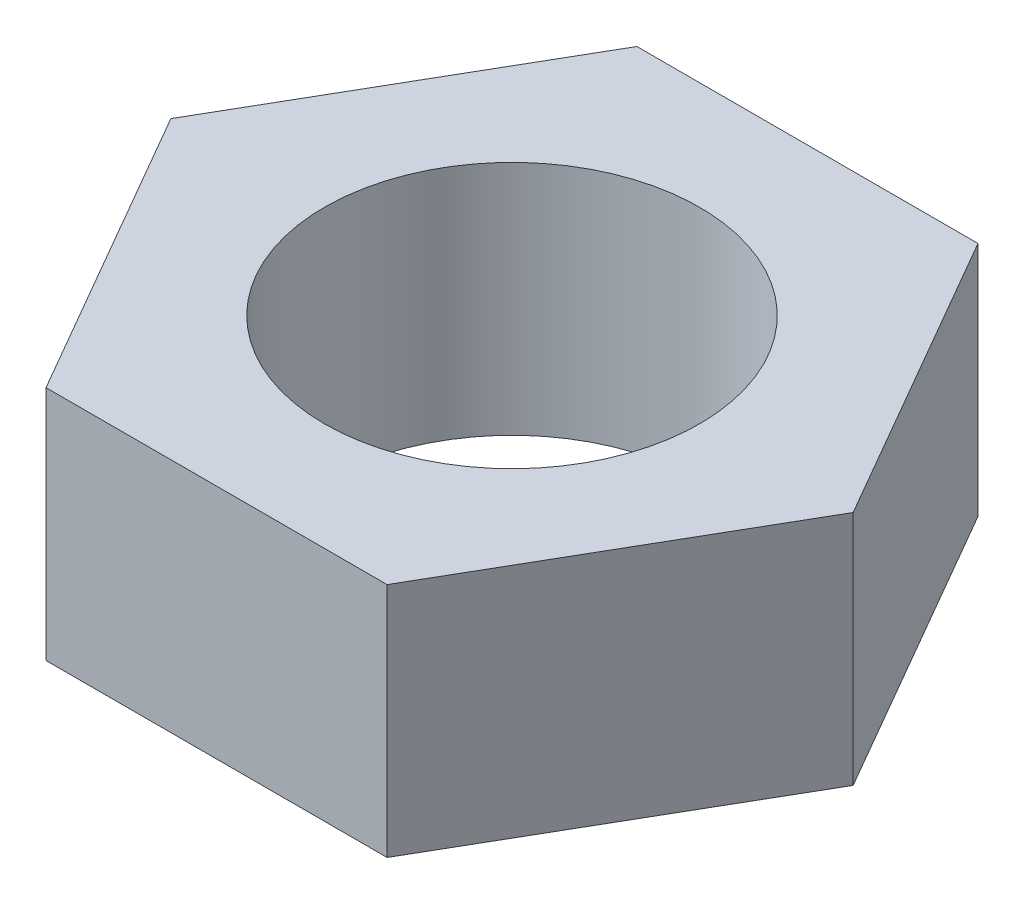
ISO-10303-21;
HEADER;
FILE_DESCRIPTION(('STEP AP214'),'2;1');
FILE_NAME('part.step','',(''),(''),'','','');
FILE_SCHEMA(('AUTOMOTIVE_DESIGN { 1 0 10303 214 1 1 1 1 }'));
ENDSEC;
DATA;
#1=APPLICATION_CONTEXT('core data for automotive mechanical design processes');
#2=APPLICATION_PROTOCOL_DEFINITION('international standard','automotive_design',2000,#1);
#3=PRODUCT_CONTEXT('',#1,'mechanical');
#4=PRODUCT('Part','Part','',(#3));
#5=PRODUCT_RELATED_PRODUCT_CATEGORY('part','',(#4));
#6=PRODUCT_DEFINITION_FORMATION('','',#4);
#7=PRODUCT_DEFINITION_CONTEXT('part definition',#1,'design');
#8=PRODUCT_DEFINITION('design','',#6,#7);
#9=PRODUCT_DEFINITION_SHAPE('','',#8);
#10=(LENGTH_UNIT() NAMED_UNIT(*) SI_UNIT(.MILLI.,.METRE.));
#11=(NAMED_UNIT(*) PLANE_ANGLE_UNIT() SI_UNIT($,.RADIAN.));
#12=(NAMED_UNIT(*) SI_UNIT($,.STERADIAN.) SOLID_ANGLE_UNIT());
#13=UNCERTAINTY_MEASURE_WITH_UNIT(LENGTH_MEASURE(1.E-05),#10,'distance_accuracy_value','');
#14=(GEOMETRIC_REPRESENTATION_CONTEXT(3) GLOBAL_UNCERTAINTY_ASSIGNED_CONTEXT((#13)) GLOBAL_UNIT_ASSIGNED_CONTEXT((#10,
#11,#12)) REPRESENTATION_CONTEXT('',''));
#15=CARTESIAN_POINT('',(0.,0.,0.));
#16=DIRECTION('',(0.,0.,1.));
#17=DIRECTION('',(1.,0.,0.));
#18=AXIS2_PLACEMENT_3D('',#15,#16,#17);
#19=CARTESIAN_POINT('',(0.,24.,0.));
#20=DIRECTION('',(0.,1.,0.));
#21=DIRECTION('',(0.,0.,1.));
#22=AXIS2_PLACEMENT_3D('',#19,#20,#21);
#23=PLANE('',#22);
#24=DIRECTION('',(-0.5,0.,0.866025403784439));
#25=VECTOR('',#24,1.);
#26=CARTESIAN_POINT('',(-17.3205080756888,24.,-30.));
#27=LINE('',#26,#25);
#28=CARTESIAN_POINT('',(-17.3205080756888,24.,-30.));
#29=VERTEX_POINT('',#28);
#30=CARTESIAN_POINT('',(-34.6410161513775,24.,0.));
#31=VERTEX_POINT('',#30);
#32=EDGE_CURVE('E133',#29,#31,#27,.T.);
#33=ORIENTED_EDGE('',*,*,#32,.T.);
#34=DIRECTION('',(0.5,0.,0.866025403784439));
#35=VECTOR('',#34,1.);
#36=CARTESIAN_POINT('',(-34.6410161513775,24.,0.));
#37=LINE('',#36,#35);
#38=CARTESIAN_POINT('',(-17.3205080756888,24.,30.));
#39=VERTEX_POINT('',#38);
#40=EDGE_CURVE('E91',#31,#39,#37,.T.);
#41=ORIENTED_EDGE('',*,*,#40,.T.);
#42=DIRECTION('',(1.,0.,0.));
#43=VECTOR('',#42,1.);
#44=CARTESIAN_POINT('',(-17.3205080756888,24.,30.));
#45=LINE('',#44,#43);
#46=CARTESIAN_POINT('',(17.3205080756888,24.,30.));
#47=VERTEX_POINT('',#46);
#48=EDGE_CURVE('E104',#39,#47,#45,.T.);
#49=ORIENTED_EDGE('',*,*,#48,.T.);
#50=DIRECTION('',(0.5,0.,-0.866025403784439));
#51=VECTOR('',#50,1.);
#52=CARTESIAN_POINT('',(17.3205080756888,24.,30.));
#53=LINE('',#52,#51);
#54=CARTESIAN_POINT('',(34.6410161513775,24.,0.));
#55=VERTEX_POINT('',#54);
#56=EDGE_CURVE('E98',#47,#55,#53,.T.);
#57=ORIENTED_EDGE('',*,*,#56,.T.);
#58=DIRECTION('',(-0.5,0.,-0.866025403784439));
#59=VECTOR('',#58,1.);
#60=CARTESIAN_POINT('',(34.6410161513775,24.,0.));
#61=LINE('',#60,#59);
#62=CARTESIAN_POINT('',(17.3205080756888,24.,-30.));
#63=VERTEX_POINT('',#62);
#64=EDGE_CURVE('E102',#55,#63,#61,.T.);
#65=ORIENTED_EDGE('',*,*,#64,.T.);
#66=DIRECTION('',(-1.,0.,0.));
#67=VECTOR('',#66,1.);
#68=CARTESIAN_POINT('',(17.3205080756888,24.,-30.));
#69=LINE('',#68,#67);
#70=EDGE_CURVE('E54',#63,#29,#69,.T.);
#71=ORIENTED_EDGE('',*,*,#70,.T.);
#72=EDGE_LOOP('',(#33,#41,#49,#57,#65,#71));
#73=FACE_BOUND('',#72,.T.);
#74=CARTESIAN_POINT('',(0.,24.,0.));
#75=DIRECTION('',(0.,1.,0.));
#76=DIRECTION('',(0.,0.,1.));
#77=AXIS2_PLACEMENT_3D('',#74,#75,#76);
#78=CIRCLE('',#77,19.05);
#79=CARTESIAN_POINT('',(0.,24.,19.05));
#80=VERTEX_POINT('',#79);
#81=EDGE_CURVE('E126',#80,#80,#78,.T.);
#82=ORIENTED_EDGE('',*,*,#81,.F.);
#83=EDGE_LOOP('',(#82));
#84=FACE_BOUND('',#83,.T.);
#85=ADVANCED_FACE('F37',(#73,#84),#23,.T.);
#86=CARTESIAN_POINT('',(0.,0.,0.));
#87=DIRECTION('',(0.,1.,0.));
#88=DIRECTION('',(0.,0.,1.));
#89=AXIS2_PLACEMENT_3D('',#86,#87,#88);
#90=PLANE('',#89);
#91=DIRECTION('',(-0.5,0.,0.866025403784439));
#92=VECTOR('',#91,1.);
#93=CARTESIAN_POINT('',(-17.3205080756888,0.,-30.));
#94=LINE('',#93,#92);
#95=CARTESIAN_POINT('',(-17.3205080756888,0.,-30.));
#96=VERTEX_POINT('',#95);
#97=CARTESIAN_POINT('',(-34.6410161513775,0.,0.));
#98=VERTEX_POINT('',#97);
#99=EDGE_CURVE('E122',#96,#98,#94,.T.);
#100=ORIENTED_EDGE('',*,*,#99,.F.);
#101=DIRECTION('',(-1.,0.,0.));
#102=VECTOR('',#101,1.);
#103=CARTESIAN_POINT('',(17.3205080756888,0.,-30.));
#104=LINE('',#103,#102);
#105=CARTESIAN_POINT('',(17.3205080756888,0.,-30.));
#106=VERTEX_POINT('',#105);
#107=EDGE_CURVE('E83',#106,#96,#104,.T.);
#108=ORIENTED_EDGE('',*,*,#107,.F.);
#109=DIRECTION('',(-0.5,0.,-0.866025403784439));
#110=VECTOR('',#109,1.);
#111=CARTESIAN_POINT('',(34.6410161513775,0.,0.));
#112=LINE('',#111,#110);
#113=CARTESIAN_POINT('',(34.6410161513775,0.,0.));
#114=VERTEX_POINT('',#113);
#115=EDGE_CURVE('E77',#114,#106,#112,.T.);
#116=ORIENTED_EDGE('',*,*,#115,.F.);
#117=DIRECTION('',(0.5,0.,-0.866025403784439));
#118=VECTOR('',#117,1.);
#119=CARTESIAN_POINT('',(17.3205080756888,0.,30.));
#120=LINE('',#119,#118);
#121=CARTESIAN_POINT('',(17.3205080756888,0.,30.));
#122=VERTEX_POINT('',#121);
#123=EDGE_CURVE('E112',#122,#114,#120,.T.);
#124=ORIENTED_EDGE('',*,*,#123,.F.);
#125=DIRECTION('',(1.,0.,0.));
#126=VECTOR('',#125,1.);
#127=CARTESIAN_POINT('',(-17.3205080756888,0.,30.));
#128=LINE('',#127,#126);
#129=CARTESIAN_POINT('',(-17.3205080756888,0.,30.));
#130=VERTEX_POINT('',#129);
#131=EDGE_CURVE('E128',#130,#122,#128,.T.);
#132=ORIENTED_EDGE('',*,*,#131,.F.);
#133=DIRECTION('',(0.5,0.,0.866025403784439));
#134=VECTOR('',#133,1.);
#135=CARTESIAN_POINT('',(-34.6410161513775,0.,0.));
#136=LINE('',#135,#134);
#137=EDGE_CURVE('E125',#98,#130,#136,.T.);
#138=ORIENTED_EDGE('',*,*,#137,.F.);
#139=EDGE_LOOP('',(#100,#108,#116,#124,#132,#138));
#140=FACE_BOUND('',#139,.T.);
#141=CARTESIAN_POINT('',(0.,0.,0.));
#142=DIRECTION('',(0.,1.,0.));
#143=DIRECTION('',(0.,0.,1.));
#144=AXIS2_PLACEMENT_3D('',#141,#142,#143);
#145=CIRCLE('',#144,19.05);
#146=CARTESIAN_POINT('',(0.,0.,19.05));
#147=VERTEX_POINT('',#146);
#148=EDGE_CURVE('E226',#147,#147,#145,.T.);
#149=ORIENTED_EDGE('',*,*,#148,.T.);
#150=EDGE_LOOP('',(#149));
#151=FACE_BOUND('',#150,.T.);
#152=ADVANCED_FACE('F142',(#140,#151),#90,.F.);
#153=CARTESIAN_POINT('',(-17.3205080756888,24.,-30.));
#154=DIRECTION('',(0.866025403784439,0.,0.5));
#155=DIRECTION('',(0.5,0.,-0.866025403784439));
#156=AXIS2_PLACEMENT_3D('',#153,#154,#155);
#157=PLANE('',#156);
#158=ORIENTED_EDGE('',*,*,#99,.T.);
#159=DIRECTION('',(0.,-1.,0.));
#160=VECTOR('',#159,1.);
#161=CARTESIAN_POINT('',(-34.6410161513775,24.,0.));
#162=LINE('',#161,#160);
#163=EDGE_CURVE('E11',#31,#98,#162,.T.);
#164=ORIENTED_EDGE('',*,*,#163,.F.);
#165=ORIENTED_EDGE('',*,*,#32,.F.);
#166=DIRECTION('',(0.,-1.,0.));
#167=VECTOR('',#166,1.);
#168=CARTESIAN_POINT('',(-17.3205080756888,24.,-30.));
#169=LINE('',#168,#167);
#170=EDGE_CURVE('E118',#29,#96,#169,.T.);
#171=ORIENTED_EDGE('',*,*,#170,.T.);
#172=EDGE_LOOP('',(#158,#164,#165,#171));
#173=FACE_BOUND('',#172,.T.);
#174=ADVANCED_FACE('F39',(#173),#157,.F.);
#175=CARTESIAN_POINT('',(-34.6410161513775,24.,0.));
#176=DIRECTION('',(0.866025403784438,0.,-0.5));
#177=DIRECTION('',(-0.5,0.,-0.866025403784439));
#178=AXIS2_PLACEMENT_3D('',#175,#176,#177);
#179=PLANE('',#178);
#180=ORIENTED_EDGE('',*,*,#137,.T.);
#181=DIRECTION('',(0.,-1.,0.));
#182=VECTOR('',#181,1.);
#183=CARTESIAN_POINT('',(-17.3205080756888,24.,30.));
#184=LINE('',#183,#182);
#185=EDGE_CURVE('E46',#39,#130,#184,.T.);
#186=ORIENTED_EDGE('',*,*,#185,.F.);
#187=ORIENTED_EDGE('',*,*,#40,.F.);
#188=ORIENTED_EDGE('',*,*,#163,.T.);
#189=EDGE_LOOP('',(#180,#186,#187,#188));
#190=FACE_BOUND('',#189,.T.);
#191=ADVANCED_FACE('F167',(#190),#179,.F.);
#192=CARTESIAN_POINT('',(-17.3205080756888,24.,30.));
#193=DIRECTION('',(0.,0.,-1.));
#194=DIRECTION('',(-1.,0.,0.));
#195=AXIS2_PLACEMENT_3D('',#192,#193,#194);
#196=PLANE('',#195);
#197=ORIENTED_EDGE('',*,*,#131,.T.);
#198=DIRECTION('',(0.,-1.,0.));
#199=VECTOR('',#198,1.);
#200=CARTESIAN_POINT('',(17.3205080756888,24.,30.));
#201=LINE('',#200,#199);
#202=EDGE_CURVE('E113',#47,#122,#201,.T.);
#203=ORIENTED_EDGE('',*,*,#202,.F.);
#204=ORIENTED_EDGE('',*,*,#48,.F.);
#205=ORIENTED_EDGE('',*,*,#185,.T.);
#206=EDGE_LOOP('',(#197,#203,#204,#205));
#207=FACE_BOUND('',#206,.T.);
#208=ADVANCED_FACE('F139',(#207),#196,.F.);
#209=CARTESIAN_POINT('',(17.3205080756888,24.,30.));
#210=DIRECTION('',(-0.866025403784439,0.,-0.5));
#211=DIRECTION('',(-0.5,0.,0.866025403784439));
#212=AXIS2_PLACEMENT_3D('',#209,#210,#211);
#213=PLANE('',#212);
#214=ORIENTED_EDGE('',*,*,#123,.T.);
#215=DIRECTION('',(0.,-1.,0.));
#216=VECTOR('',#215,1.);
#217=CARTESIAN_POINT('',(34.6410161513775,24.,0.));
#218=LINE('',#217,#216);
#219=EDGE_CURVE('E109',#55,#114,#218,.T.);
#220=ORIENTED_EDGE('',*,*,#219,.F.);
#221=ORIENTED_EDGE('',*,*,#56,.F.);
#222=ORIENTED_EDGE('',*,*,#202,.T.);
#223=EDGE_LOOP('',(#214,#220,#221,#222));
#224=FACE_BOUND('',#223,.T.);
#225=ADVANCED_FACE('F110',(#224),#213,.F.);
#226=CARTESIAN_POINT('',(34.6410161513775,24.,0.));
#227=DIRECTION('',(-0.866025403784438,0.,0.5));
#228=DIRECTION('',(0.5,0.,0.866025403784439));
#229=AXIS2_PLACEMENT_3D('',#226,#227,#228);
#230=PLANE('',#229);
#231=ORIENTED_EDGE('',*,*,#115,.T.);
#232=DIRECTION('',(0.,-1.,0.));
#233=VECTOR('',#232,1.);
#234=CARTESIAN_POINT('',(17.3205080756888,24.,-30.));
#235=LINE('',#234,#233);
#236=EDGE_CURVE('E114',#63,#106,#235,.T.);
#237=ORIENTED_EDGE('',*,*,#236,.F.);
#238=ORIENTED_EDGE('',*,*,#64,.F.);
#239=ORIENTED_EDGE('',*,*,#219,.T.);
#240=EDGE_LOOP('',(#231,#237,#238,#239));
#241=FACE_BOUND('',#240,.T.);
#242=ADVANCED_FACE('F116',(#241),#230,.F.);
#243=CARTESIAN_POINT('',(17.3205080756888,24.,-30.));
#244=DIRECTION('',(0.,0.,1.));
#245=DIRECTION('',(1.,0.,0.));
#246=AXIS2_PLACEMENT_3D('',#243,#244,#245);
#247=PLANE('',#246);
#248=ORIENTED_EDGE('',*,*,#107,.T.);
#249=ORIENTED_EDGE('',*,*,#170,.F.);
#250=ORIENTED_EDGE('',*,*,#70,.F.);
#251=ORIENTED_EDGE('',*,*,#236,.T.);
#252=EDGE_LOOP('',(#248,#249,#250,#251));
#253=FACE_BOUND('',#252,.T.);
#254=ADVANCED_FACE('F147',(#253),#247,.F.);
#255=CARTESIAN_POINT('',(0.,24.,0.));
#256=DIRECTION('',(0.,-1.,0.));
#257=DIRECTION('',(0.,0.,-1.));
#258=AXIS2_PLACEMENT_3D('',#255,#256,#257);
#259=CYLINDRICAL_SURFACE('',#258,19.05);
#260=ORIENTED_EDGE('',*,*,#81,.T.);
#261=EDGE_LOOP('',(#260));
#262=FACE_BOUND('',#261,.T.);
#263=ORIENTED_EDGE('',*,*,#148,.F.);
#264=EDGE_LOOP('',(#263));
#265=FACE_BOUND('',#264,.T.);
#266=ADVANCED_FACE('F149',(#262,#265),#259,.F.);
#267=CLOSED_SHELL('',(#85,#152,#174,#191,#208,#225,#242,#254,#266));
#268=MANIFOLD_SOLID_BREP('B2',#267);
#269=ADVANCED_BREP_SHAPE_REPRESENTATION('',(#18,#268),#14);
#270=SHAPE_DEFINITION_REPRESENTATION(#9,#269);
ENDSEC;
END-ISO-10303-21;
